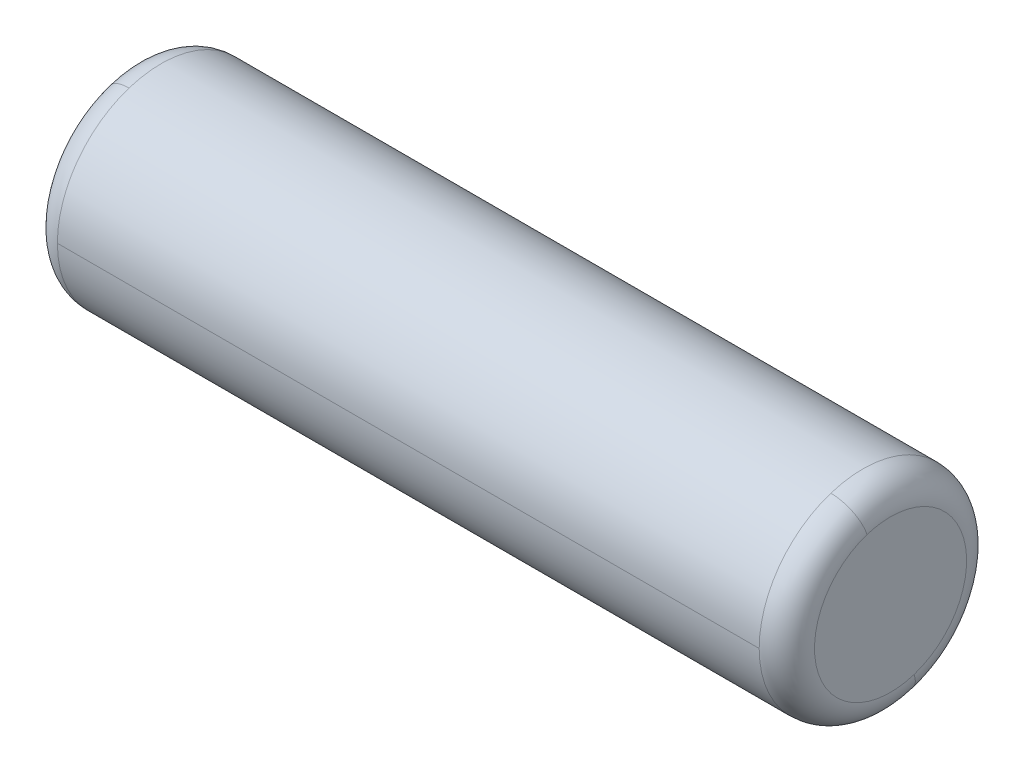
ISO-10303-21;
HEADER;
FILE_DESCRIPTION(('STEP AP214'),'2;1');
FILE_NAME('part.step','',(''),(''),'','','');
FILE_SCHEMA(('AUTOMOTIVE_DESIGN { 1 0 10303 214 1 1 1 1 }'));
ENDSEC;
DATA;
#1=APPLICATION_CONTEXT('core data for automotive mechanical design processes');
#2=APPLICATION_PROTOCOL_DEFINITION('international standard','automotive_design',2000,#1);
#3=PRODUCT_CONTEXT('',#1,'mechanical');
#4=PRODUCT('Part','Part','',(#3));
#5=PRODUCT_RELATED_PRODUCT_CATEGORY('part','',(#4));
#6=PRODUCT_DEFINITION_FORMATION('','',#4);
#7=PRODUCT_DEFINITION_CONTEXT('part definition',#1,'design');
#8=PRODUCT_DEFINITION('design','',#6,#7);
#9=PRODUCT_DEFINITION_SHAPE('','',#8);
#10=(LENGTH_UNIT() NAMED_UNIT(*) SI_UNIT(.MILLI.,.METRE.));
#11=(NAMED_UNIT(*) PLANE_ANGLE_UNIT() SI_UNIT($,.RADIAN.));
#12=(NAMED_UNIT(*) SI_UNIT($,.STERADIAN.) SOLID_ANGLE_UNIT());
#13=UNCERTAINTY_MEASURE_WITH_UNIT(LENGTH_MEASURE(1.E-05),#10,'distance_accuracy_value','');
#14=(GEOMETRIC_REPRESENTATION_CONTEXT(3) GLOBAL_UNCERTAINTY_ASSIGNED_CONTEXT((#13)) GLOBAL_UNIT_ASSIGNED_CONTEXT((#10,
#11,#12)) REPRESENTATION_CONTEXT('',''));
#15=CARTESIAN_POINT('',(0.,0.,0.));
#16=DIRECTION('',(0.,0.,1.));
#17=DIRECTION('',(1.,0.,0.));
#18=AXIS2_PLACEMENT_3D('',#15,#16,#17);
#19=CARTESIAN_POINT('',(2.35,8.,0.));
#20=DIRECTION('',(1.,0.,0.));
#21=DIRECTION('',(0.,0.,-1.));
#22=AXIS2_PLACEMENT_3D('',#19,#20,#21);
#23=PLANE('',#22);
#24=CARTESIAN_POINT('',(2.35,8.69744144528296,0.226612462541579));
#25=CARTESIAN_POINT('',(2.35,8.69373374586507,0.238024411682907));
#26=CARTESIAN_POINT('',(2.35,8.6897454884511,0.249345179232635));
#27=CARTESIAN_POINT('',(2.35,8.68121851156343,0.271777475978529));
#28=CARTESIAN_POINT('',(2.35,8.67667979208974,0.282889005174697));
#29=CARTESIAN_POINT('',(2.35,8.6670625450151,0.304875950043115));
#30=CARTESIAN_POINT('',(2.35,8.66198401741415,0.315751365715366));
#31=CARTESIAN_POINT('',(2.35,8.65129946379298,0.337239912249846));
#32=CARTESIAN_POINT('',(2.35,8.64569343777276,0.347853043112075));
#33=CARTESIAN_POINT('',(2.35,8.6339673726004,0.368791444416637));
#34=CARTESIAN_POINT('',(2.35,8.62784733344826,0.37911671485897));
#35=CARTESIAN_POINT('',(2.35,8.61510799111368,0.399454522892141));
#36=CARTESIAN_POINT('',(2.35,8.60848868793123,0.409467060482979));
#37=CARTESIAN_POINT('',(2.35,8.5947667625726,0.429155281184004));
#38=CARTESIAN_POINT('',(2.35,8.58766414039641,0.438830964294191));
#39=CARTESIAN_POINT('',(2.35,8.57299268827631,0.457822166612945));
#40=CARTESIAN_POINT('',(2.35,8.5654238583324,0.467137685821512));
#41=CARTESIAN_POINT('',(2.35,8.54983822454741,0.485386118395884));
#42=CARTESIAN_POINT('',(2.35,8.54182142070634,0.49431903176169));
#43=CARTESIAN_POINT('',(2.35,8.52535915233747,0.511780732490374));
#44=CARTESIAN_POINT('',(2.35,8.51691368780968,0.520309519853254));
#45=CARTESIAN_POINT('',(2.35,8.4996144439237,0.536942421977464));
#46=CARTESIAN_POINT('',(2.35,8.49076066456552,0.545046536738796));
#47=CARTESIAN_POINT('',(2.35,8.47266612055073,0.560810570138373));
#48=CARTESIAN_POINT('',(2.35,8.46342535589413,0.568470488776618));
#49=CARTESIAN_POINT('',(2.35,8.44457910309343,0.583327676514891));
#50=CARTESIAN_POINT('',(2.35,8.43497361494933,0.590524945614918));
#51=CARTESIAN_POINT('',(2.35,8.41542105563604,0.60443949542514));
#52=CARTESIAN_POINT('',(2.35,8.40547398446686,0.611156776135335));
#53=CARTESIAN_POINT('',(2.35,8.3852622224691,0.624095166648283));
#54=CARTESIAN_POINT('',(2.35,8.37499753164051,0.630316276451037));
#55=CARTESIAN_POINT('',(2.35,8.35417525886322,0.642247337950685));
#56=CARTESIAN_POINT('',(2.35,8.34361767691453,0.64795728964758));
#57=CARTESIAN_POINT('',(2.35,8.32223505603667,0.658852279161742));
#58=CARTESIAN_POINT('',(2.35,8.3114100171075,0.664037316979008));
#59=CARTESIAN_POINT('',(2.35,8.28951856073565,0.673869987523654));
#60=CARTESIAN_POINT('',(2.35,8.27845214329297,0.678517620251034));
#61=CARTESIAN_POINT('',(2.35,8.256104589863,0.687264284061582));
#62=CARTESIAN_POINT('',(2.35,8.24482345387572,0.69136331514475));
#63=CARTESIAN_POINT('',(2.35,8.22207364060126,0.699002900741963));
#64=CARTESIAN_POINT('',(2.35,8.21060496331408,0.702543455256008));
#65=CARTESIAN_POINT('',(2.35,8.18750769648795,0.709057558209035));
#66=CARTESIAN_POINT('',(2.35,8.175879106949,0.712031106648016));
#67=CARTESIAN_POINT('',(2.35,8.15249002991007,0.717404033912273));
#68=CARTESIAN_POINT('',(2.35,8.14072954241009,0.719803412737549));
#69=CARTESIAN_POINT('',(2.35,8.11710500149358,0.724022220460645));
#70=CARTESIAN_POINT('',(2.35,8.10524094807706,0.725841649358465));
#71=CARTESIAN_POINT('',(2.35,8.08143785687131,0.728896174063071));
#72=CARTESIAN_POINT('',(2.35,8.06949881908209,0.730131269869857));
#73=CARTESIAN_POINT('',(2.35,8.04557452131872,0.732014152938414));
#74=CARTESIAN_POINT('',(2.35,8.03358926134458,0.732661940200186));
#75=CARTESIAN_POINT('',(2.35,8.00960139275243,0.733368645602461));
#76=CARTESIAN_POINT('',(2.35,7.99759878413442,0.733427563742966));
#77=CARTESIAN_POINT('',(2.35,7.97360513359,0.732956388963745));
#78=CARTESIAN_POINT('',(2.35,7.9616140916636,0.732426296044021));
#79=CARTESIAN_POINT('',(2.35,7.93767246197268,0.730778376184618));
#80=CARTESIAN_POINT('',(2.35,7.92572187420817,0.72966054924494));
#81=CARTESIAN_POINT('',(2.35,7.90188994285371,0.726839854288637));
#82=CARTESIAN_POINT('',(2.35,7.89000859926377,0.725136986272012));
#83=CARTESIAN_POINT('',(2.35,7.86634377945583,0.721150311520021));
#84=CARTESIAN_POINT('',(2.35,7.85456030323785,0.718866504784656));
#85=CARTESIAN_POINT('',(2.35,7.83111960560015,0.713723454485647));
#86=CARTESIAN_POINT('',(2.35,7.81946238418044,0.710864210922004));
#87=CARTESIAN_POINT('',(2.35,7.79630227940675,0.704577175134626));
#88=CARTESIAN_POINT('',(2.35,7.78479939605277,0.70114938291089));
#89=CARTESIAN_POINT('',(2.35,7.76197567886407,0.693733507655033));
#90=CARTESIAN_POINT('',(2.35,7.75065484502936,0.689745424622912));
#91=CARTESIAN_POINT('',(2.35,7.72822249975948,0.681218575391621));
#92=CARTESIAN_POINT('',(2.35,7.71711098832432,0.676679809192452));
#93=CARTESIAN_POINT('',(2.35,7.69512405645787,0.66706252791239));
#94=CARTESIAN_POINT('',(2.35,7.68424863602657,0.661984012831497));
#95=CARTESIAN_POINT('',(2.35,7.66276008600822,0.651299468375642));
#96=CARTESIAN_POINT('',(2.35,7.65214695642118,0.64569343900068));
#97=CARTESIAN_POINT('',(2.35,7.63120855605011,0.63396737137248));
#98=CARTESIAN_POINT('',(2.35,7.6208832852661,0.627847333119244));
#99=CARTESIAN_POINT('',(2.35,7.60054547698279,0.615107991442699));
#100=CARTESIAN_POINT('',(2.35,7.59053293948351,0.608488688019392));
#101=CARTESIAN_POINT('',(2.35,7.57084471884951,0.594766762484436));
#102=CARTESIAN_POINT('',(2.35,7.56116903571479,0.587664140372787));
#103=CARTESIAN_POINT('',(2.35,7.54217783337808,0.572992688299932));
#104=CARTESIAN_POINT('',(2.35,7.53286231417608,0.565423858338725));
#105=CARTESIAN_POINT('',(2.35,7.51461388160652,0.549838224541081));
#106=CARTESIAN_POINT('',(2.35,7.50568096823896,0.541821420704644));
#107=CARTESIAN_POINT('',(2.35,7.48821926750898,0.52535915233917));
#108=CARTESIAN_POINT('',(2.35,7.47969048014657,0.516913687810134));
#109=CARTESIAN_POINT('',(2.35,7.46305757802271,0.499614443923248));
#110=CARTESIAN_POINT('',(2.35,7.45495346326125,0.490760664565397));
#111=CARTESIAN_POINT('',(2.35,7.43918942986158,0.472666120550857));
#112=CARTESIAN_POINT('',(2.35,7.43152951122337,0.463425355894166));
#113=CARTESIAN_POINT('',(2.35,7.41667232348512,0.444579103093397));
#114=CARTESIAN_POINT('',(2.35,7.40947505438509,0.434973614949318));
#115=CARTESIAN_POINT('',(2.35,7.39556050457486,0.415421055636054));
#116=CARTESIAN_POINT('',(2.35,7.38884322386466,0.405473984466868));
#117=CARTESIAN_POINT('',(2.35,7.37590483335172,0.385262222469097));
#118=CARTESIAN_POINT('',(2.35,7.36968372354896,0.374997531640512));
#119=CARTESIAN_POINT('',(2.35,7.35775266204932,0.354175258863227));
#120=CARTESIAN_POINT('',(2.35,7.35204271035242,0.343617676914528));
#121=CARTESIAN_POINT('',(2.35,7.34114772083826,0.322235056036667));
#122=CARTESIAN_POINT('',(2.35,7.33596268302099,0.311410017107504));
#123=CARTESIAN_POINT('',(2.35,7.32613001247635,0.289518560735656));
#124=CARTESIAN_POINT('',(2.35,7.32148237974896,0.27845214329297));
#125=CARTESIAN_POINT('',(2.35,7.31273571593842,0.256104589863003));
#126=CARTESIAN_POINT('',(2.35,7.30863668485526,0.244823453875721));
#127=CARTESIAN_POINT('',(2.35,7.30099709925803,0.222073640601254));
#128=CARTESIAN_POINT('',(2.35,7.29745654474396,0.210604963314069));
#129=CARTESIAN_POINT('',(2.35,7.290942441791,0.187507696487958));
#130=CARTESIAN_POINT('',(2.35,7.28796889335211,0.175879106949032));
#131=CARTESIAN_POINT('',(2.35,7.2825959660876,0.152490029910033));
#132=CARTESIAN_POINT('',(2.35,7.28019658726198,0.140729542409959));
#133=CARTESIAN_POINT('',(2.35,7.27597777953982,0.117105001493709));
#134=CARTESIAN_POINT('',(2.35,7.27415835064329,0.105240948077533));
#135=CARTESIAN_POINT('',(2.35,7.27110382593518,0.0814378568708378));
#136=CARTESIAN_POINT('',(2.35,7.26986873012361,0.0694988190803187));
#137=CARTESIAN_POINT('',(2.35,7.26798584706812,0.0455745213205006));
#138=CARTESIAN_POINT('',(2.35,7.2673380598242,0.0335892613512017));
#139=CARTESIAN_POINT('',(2.35,7.26663135437315,0.00960139274580662));
#140=CARTESIAN_POINT('',(2.35,7.26657243616601,-0.00240121589028959));
#141=CARTESIAN_POINT('',(2.35,7.26704361112728,-0.026394866385287));
#142=CARTESIAN_POINT('',(2.35,7.26757370429567,-0.0383859082441882));
#143=CARTESIAN_POINT('',(2.35,7.26922162347569,-0.0623275381195325));
#144=CARTESIAN_POINT('',(2.35,7.27033944948731,-0.0742781261359757));
#145=CARTESIAN_POINT('',(2.35,7.27316014697912,-0.0981100568021429));
#146=CARTESIAN_POINT('',(2.35,7.27486301845932,-0.109991399451867));
#147=CARTESIAN_POINT('',(2.35,7.27884968374865,-0.13365622182853));
#148=CARTESIAN_POINT('',(2.35,7.28113347755778,-0.145439701555469));
#149=CARTESIAN_POINT('',(2.35,7.28627656317192,-0.168880389606531));
#150=CARTESIAN_POINT('',(2.35,7.28913585497692,-0.180537597930652));
#151=CARTESIAN_POINT('',(2.35,7.29542275896644,-0.203697738482153));
#152=CARTESIAN_POINT('',(2.35,7.29885037115096,-0.215200670709532));
#153=CARTESIAN_POINT('',(2.35,7.30255855471704,-0.226612462541576));
#154=B_SPLINE_CURVE_WITH_KNOTS('',3,(#24,#25,#26,#27,#28,#29,#30,#31,#32,#33,#34,#35,#36,#37,
#38,#39,#40,#41,#42,#43,#44,#45,#46,#47,#48,#49,#50,#51,#52,#53,#54,#55,#56,#57,#58,#59,#60,#61,
#62,#63,#64,#65,#66,#67,#68,#69,#70,#71,#72,#73,#74,#75,#76,#77,#78,#79,#80,#81,#82,#83,#84,#85,
#86,#87,#88,#89,#90,#91,#92,#93,#94,#95,#96,#97,#98,#99,#100,#101,#102,#103,#104,#105,#106,#107,
#108,#109,#110,#111,#112,#113,#114,#115,#116,#117,#118,#119,#120,#121,#122,#123,#124,#125,#126,
#127,#128,#129,#130,#131,#132,#133,#134,#135,#136,#137,#138,#139,#140,#141,#142,#143,#144,#145,
#146,#147,#148,#149,#150,#151,#152,#153),.UNSPECIFIED.,.F.,.F.,(4,2,2,2,2,2,2,2,2,2,2,2,2,2,2,2,
2,2,2,2,2,2,2,2,2,2,2,2,2,2,2,2,2,2,2,2,2,2,2,2,2,2,2,2,2,2,2,2,2,2,2,2,2,2,2,2,2,2,2,2,2,2,2,2,
4),(0.,0.0359938018335968,0.0719876036671936,0.107981405500791,0.143975207334387,
0.179969009167985,0.215962811001581,0.251956612835178,0.287950414668774,0.323944216502372,
0.359938018335968,0.395931820169565,0.431925622003162,0.467919423836759,0.503913225670357,
0.539907027503953,0.57590082933755,0.611894631171146,0.647888433004743,0.683882234838341,
0.719876036671937,0.755869838505534,0.79186364033913,0.827857442172728,0.863851244006325,
0.899845045839922,0.935838847673518,0.971832649507114,1.00782645134071,1.04382025317431,
1.07981405500791,1.1158078568415,1.1518016586751,1.1877954605087,1.22378926234229,
1.25978306417589,1.29577686600949,1.33177066784308,1.36776446967668,1.40375827151028,
1.43975207334387,1.47574587517747,1.51173967701107,1.54773347884467,1.58372728067826,
1.61972108251186,1.65571488434545,1.69170868617905,1.72770248801265,1.76369628984625,
1.79969009167984,1.83568389351344,1.87167769534704,1.90767149718063,1.94366529901423,
1.97965910084783,2.01565290268142,2.05164670451502,2.08764050634862,2.12363430818221,
2.15962811001581,2.19562191184941,2.231615713683,2.2676095155166,2.3036033173502),.UNSPECIFIED.);
#155=CARTESIAN_POINT('',(2.35,8.69744144528296,0.226612462541579));
#156=VERTEX_POINT('',#155);
#157=CARTESIAN_POINT('',(2.35,7.30255855471704,-0.226612462541579));
#158=VERTEX_POINT('',#157);
#159=EDGE_CURVE('E11',#156,#158,#154,.T.);
#160=ORIENTED_EDGE('',*,*,#159,.F.);
#161=CARTESIAN_POINT('',(2.35,7.30255855471704,-0.226612462541579));
#162=CARTESIAN_POINT('',(2.35,7.30626625413493,-0.238024411682907));
#163=CARTESIAN_POINT('',(2.35,7.3102545115489,-0.249345179232634));
#164=CARTESIAN_POINT('',(2.35,7.31878148843657,-0.271777475978529));
#165=CARTESIAN_POINT('',(2.35,7.32332020791026,-0.282889005174697));
#166=CARTESIAN_POINT('',(2.35,7.3329374549849,-0.304875950043115));
#167=CARTESIAN_POINT('',(2.35,7.33801598258585,-0.315751365715366));
#168=CARTESIAN_POINT('',(2.35,7.34870053620702,-0.337239912249845));
#169=CARTESIAN_POINT('',(2.35,7.35430656222724,-0.347853043112074));
#170=CARTESIAN_POINT('',(2.35,7.3660326273996,-0.368791444416637));
#171=CARTESIAN_POINT('',(2.35,7.37215266655174,-0.37911671485897));
#172=CARTESIAN_POINT('',(2.35,7.38489200888632,-0.399454522892141));
#173=CARTESIAN_POINT('',(2.35,7.39151131206877,-0.409467060482979));
#174=CARTESIAN_POINT('',(2.35,7.4052332374274,-0.429155281184004));
#175=CARTESIAN_POINT('',(2.35,7.41233585960359,-0.438830964294191));
#176=CARTESIAN_POINT('',(2.35,7.42700731172369,-0.457822166612945));
#177=CARTESIAN_POINT('',(2.35,7.43457614166761,-0.467137685821511));
#178=CARTESIAN_POINT('',(2.35,7.45016177545259,-0.485386118395884));
#179=CARTESIAN_POINT('',(2.35,7.45817857929366,-0.49431903176169));
#180=CARTESIAN_POINT('',(2.35,7.47464084766253,-0.511780732490374));
#181=CARTESIAN_POINT('',(2.35,7.48308631219032,-0.520309519853254));
#182=CARTESIAN_POINT('',(2.35,7.5003855560763,-0.536942421977464));
#183=CARTESIAN_POINT('',(2.35,7.50923933543448,-0.545046536738796));
#184=CARTESIAN_POINT('',(2.35,7.52733387944927,-0.560810570138372));
#185=CARTESIAN_POINT('',(2.35,7.53657464410587,-0.568470488776618));
#186=CARTESIAN_POINT('',(2.35,7.55542089690657,-0.583327676514891));
#187=CARTESIAN_POINT('',(2.35,7.56502638505067,-0.590524945614918));
#188=CARTESIAN_POINT('',(2.35,7.58457894436396,-0.60443949542514));
#189=CARTESIAN_POINT('',(2.35,7.59452601553313,-0.611156776135335));
#190=CARTESIAN_POINT('',(2.35,7.6147377775309,-0.624095166648283));
#191=CARTESIAN_POINT('',(2.35,7.62500246835949,-0.630316276451036));
#192=CARTESIAN_POINT('',(2.35,7.64582474113677,-0.642247337950685));
#193=CARTESIAN_POINT('',(2.35,7.65638232308547,-0.64795728964758));
#194=CARTESIAN_POINT('',(2.35,7.67776494396333,-0.658852279161742));
#195=CARTESIAN_POINT('',(2.35,7.6885899828925,-0.664037316979008));
#196=CARTESIAN_POINT('',(2.35,7.71048143926435,-0.673869987523654));
#197=CARTESIAN_POINT('',(2.35,7.72154785670703,-0.678517620251034));
#198=CARTESIAN_POINT('',(2.35,7.743895410137,-0.687264284061582));
#199=CARTESIAN_POINT('',(2.35,7.75517654612428,-0.69136331514475));
#200=CARTESIAN_POINT('',(2.35,7.77792635939874,-0.699002900741963));
#201=CARTESIAN_POINT('',(2.35,7.78939503668592,-0.702543455256008));
#202=CARTESIAN_POINT('',(2.35,7.81249230351205,-0.709057558209034));
#203=CARTESIAN_POINT('',(2.35,7.824120893051,-0.712031106648016));
#204=CARTESIAN_POINT('',(2.35,7.84750997008993,-0.717404033912273));
#205=CARTESIAN_POINT('',(2.35,7.85927045758991,-0.719803412737549));
#206=CARTESIAN_POINT('',(2.35,7.88289499850642,-0.724022220460645));
#207=CARTESIAN_POINT('',(2.35,7.89475905192294,-0.725841649358465));
#208=CARTESIAN_POINT('',(2.35,7.91856214312869,-0.728896174063071));
#209=CARTESIAN_POINT('',(2.35,7.93050118091791,-0.730131269869856));
#210=CARTESIAN_POINT('',(2.35,7.95442547868127,-0.732014152938414));
#211=CARTESIAN_POINT('',(2.35,7.96641073865542,-0.732661940200185));
#212=CARTESIAN_POINT('',(2.35,7.99039860724757,-0.733368645602461));
#213=CARTESIAN_POINT('',(2.35,8.00240121586558,-0.733427563742965));
#214=CARTESIAN_POINT('',(2.35,8.02639486641,-0.732956388963745));
#215=CARTESIAN_POINT('',(2.35,8.0383859083364,-0.732426296044021));
#216=CARTESIAN_POINT('',(2.35,8.06232753802732,-0.730778376184618));
#217=CARTESIAN_POINT('',(2.35,8.07427812579183,-0.72966054924494));
#218=CARTESIAN_POINT('',(2.35,8.09811005714629,-0.726839854288637));
#219=CARTESIAN_POINT('',(2.35,8.10999140073623,-0.725136986272012));
#220=CARTESIAN_POINT('',(2.35,8.13365622054417,-0.721150311520021));
#221=CARTESIAN_POINT('',(2.35,8.14543969676215,-0.718866504784656));
#222=CARTESIAN_POINT('',(2.35,8.16888039439985,-0.713723454485647));
#223=CARTESIAN_POINT('',(2.35,8.18053761581956,-0.710864210922004));
#224=CARTESIAN_POINT('',(2.35,8.20369772059325,-0.704577175134626));
#225=CARTESIAN_POINT('',(2.35,8.21520060394723,-0.701149382910891));
#226=CARTESIAN_POINT('',(2.35,8.23802432113592,-0.693733507655033));
#227=CARTESIAN_POINT('',(2.35,8.24934515497064,-0.689745424622912));
#228=CARTESIAN_POINT('',(2.35,8.27177750024052,-0.681218575391621));
#229=CARTESIAN_POINT('',(2.35,8.28288901167568,-0.676679809192452));
#230=CARTESIAN_POINT('',(2.35,8.30487594354213,-0.66706252791239));
#231=CARTESIAN_POINT('',(2.35,8.31575136397343,-0.661984012831497));
#232=CARTESIAN_POINT('',(2.35,8.33723991399178,-0.651299468375642));
#233=CARTESIAN_POINT('',(2.35,8.34785304357882,-0.64569343900068));
#234=CARTESIAN_POINT('',(2.35,8.36879144394989,-0.63396737137248));
#235=CARTESIAN_POINT('',(2.35,8.3791167147339,-0.627847333119244));
#236=CARTESIAN_POINT('',(2.35,8.39945452301721,-0.615107991442699));
#237=CARTESIAN_POINT('',(2.35,8.40946706051649,-0.608488688019392));
#238=CARTESIAN_POINT('',(2.35,8.42915528115049,-0.594766762484436));
#239=CARTESIAN_POINT('',(2.35,8.43883096428521,-0.587664140372787));
#240=CARTESIAN_POINT('',(2.35,8.45782216662192,-0.572992688299932));
#241=CARTESIAN_POINT('',(2.35,8.46713768582392,-0.565423858338725));
#242=CARTESIAN_POINT('',(2.35,8.48538611839348,-0.549838224541081));
#243=CARTESIAN_POINT('',(2.35,8.49431903176104,-0.541821420704644));
#244=CARTESIAN_POINT('',(2.35,8.51178073249102,-0.525359152339171));
#245=CARTESIAN_POINT('',(2.35,8.52030951985342,-0.516913687810134));
#246=CARTESIAN_POINT('',(2.35,8.53694242197729,-0.499614443923248));
#247=CARTESIAN_POINT('',(2.35,8.54504653673875,-0.490760664565398));
#248=CARTESIAN_POINT('',(2.35,8.56081057013842,-0.472666120550858));
#249=CARTESIAN_POINT('',(2.35,8.56847048877663,-0.463425355894167));
#250=CARTESIAN_POINT('',(2.35,8.58332767651488,-0.444579103093397));
#251=CARTESIAN_POINT('',(2.35,8.59052494561491,-0.434973614949319));
#252=CARTESIAN_POINT('',(2.35,8.60443949542514,-0.415421055636055));
#253=CARTESIAN_POINT('',(2.35,8.61115677613533,-0.405473984466869));
#254=CARTESIAN_POINT('',(2.35,8.62409516664828,-0.385262222469098));
#255=CARTESIAN_POINT('',(2.35,8.63031627645104,-0.374997531640513));
#256=CARTESIAN_POINT('',(2.35,8.64224733795068,-0.354175258863228));
#257=CARTESIAN_POINT('',(2.35,8.64795728964758,-0.343617676914529));
#258=CARTESIAN_POINT('',(2.35,8.65885227916174,-0.322235056036667));
#259=CARTESIAN_POINT('',(2.35,8.66403731697901,-0.311410017107504));
#260=CARTESIAN_POINT('',(2.35,8.67386998752365,-0.289518560735657));
#261=CARTESIAN_POINT('',(2.35,8.67851762025103,-0.278452143292971));
#262=CARTESIAN_POINT('',(2.35,8.68726428406158,-0.256104589863004));
#263=CARTESIAN_POINT('',(2.35,8.69136331514474,-0.244823453875722));
#264=CARTESIAN_POINT('',(2.35,8.69900290074197,-0.222073640601255));
#265=CARTESIAN_POINT('',(2.35,8.70254345525604,-0.21060496331407));
#266=CARTESIAN_POINT('',(2.35,8.709057558209,-0.187507696487959));
#267=CARTESIAN_POINT('',(2.35,8.71203110664789,-0.175879106949033));
#268=CARTESIAN_POINT('',(2.35,8.7174040339124,-0.152490029910034));
#269=CARTESIAN_POINT('',(2.35,8.71980341273802,-0.14072954240996));
#270=CARTESIAN_POINT('',(2.35,8.72402222046017,-0.117105001493711));
#271=CARTESIAN_POINT('',(2.35,8.72584164935671,-0.105240948077534));
#272=CARTESIAN_POINT('',(2.35,8.72889617406482,-0.0814378568708387));
#273=CARTESIAN_POINT('',(2.35,8.73013126987639,-0.0694988190803198));
#274=CARTESIAN_POINT('',(2.35,8.73201415293188,-0.045574521320502));
#275=CARTESIAN_POINT('',(2.35,8.7326619401758,-0.0335892613512031));
#276=CARTESIAN_POINT('',(2.35,8.73336864562685,-0.00960139274580803));
#277=CARTESIAN_POINT('',(2.35,8.73342756383399,0.00240121589028817));
#278=CARTESIAN_POINT('',(2.35,8.73295638887272,0.0263948663852856));
#279=CARTESIAN_POINT('',(2.35,8.73242629570433,0.0383859082441868));
#280=CARTESIAN_POINT('',(2.35,8.73077837652431,0.0623275381195311));
#281=CARTESIAN_POINT('',(2.35,8.72966055051269,0.0742781261359743));
#282=CARTESIAN_POINT('',(2.35,8.72683985302088,0.0981100568021416));
#283=CARTESIAN_POINT('',(2.35,8.72513698154068,0.109991399451866));
#284=CARTESIAN_POINT('',(2.35,8.72115031625135,0.133656221828529));
#285=CARTESIAN_POINT('',(2.35,8.71886652244222,0.145439701555469));
#286=CARTESIAN_POINT('',(2.35,8.71372343682808,0.16888038960653));
#287=CARTESIAN_POINT('',(2.35,8.71086414502308,0.180537597930652));
#288=CARTESIAN_POINT('',(2.35,8.70457724103356,0.203697738482152));
#289=CARTESIAN_POINT('',(2.35,8.70114962884904,0.215200670709531));
#290=CARTESIAN_POINT('',(2.35,8.69744144528296,0.226612462541575));
#291=B_SPLINE_CURVE_WITH_KNOTS('',3,(#161,#162,#163,#164,#165,#166,#167,#168,#169,#170,#171,
#172,#173,#174,#175,#176,#177,#178,#179,#180,#181,#182,#183,#184,#185,#186,#187,#188,#189,#190,
#191,#192,#193,#194,#195,#196,#197,#198,#199,#200,#201,#202,#203,#204,#205,#206,#207,#208,#209,
#210,#211,#212,#213,#214,#215,#216,#217,#218,#219,#220,#221,#222,#223,#224,#225,#226,#227,#228,
#229,#230,#231,#232,#233,#234,#235,#236,#237,#238,#239,#240,#241,#242,#243,#244,#245,#246,#247,
#248,#249,#250,#251,#252,#253,#254,#255,#256,#257,#258,#259,#260,#261,#262,#263,#264,#265,#266,
#267,#268,#269,#270,#271,#272,#273,#274,#275,#276,#277,#278,#279,#280,#281,#282,#283,#284,#285,
#286,#287,#288,#289,#290),.UNSPECIFIED.,.F.,.F.,(4,2,2,2,2,2,2,2,2,2,2,2,2,2,2,2,2,2,2,2,2,2,2,
2,2,2,2,2,2,2,2,2,2,2,2,2,2,2,2,2,2,2,2,2,2,2,2,2,2,2,2,2,2,2,2,2,2,2,2,2,2,2,2,2,4),(0.,
0.0359938018335969,0.0719876036671935,0.10798140550079,0.143975207334387,0.179969009167984,
0.215962811001581,0.251956612835178,0.287950414668775,0.323944216502372,0.359938018335968,
0.395931820169565,0.431925622003162,0.467919423836759,0.503913225670355,0.539907027503952,
0.57590082933755,0.611894631171147,0.647888433004743,0.68388223483834,0.719876036671937,
0.755869838505533,0.79186364033913,0.827857442172728,0.863851244006323,0.89984504583992,
0.935838847673518,0.971832649507114,1.00782645134071,1.04382025317431,1.0798140550079,
1.1158078568415,1.1518016586751,1.18779546050869,1.22378926234229,1.25978306417589,
1.29577686600949,1.33177066784308,1.36776446967668,1.40375827151028,1.43975207334387,
1.47574587517747,1.51173967701107,1.54773347884466,1.58372728067826,1.61972108251186,
1.65571488434545,1.69170868617905,1.72770248801265,1.76369628984624,1.79969009167984,
1.83568389351344,1.87167769534703,1.90767149718063,1.94366529901423,1.97965910084782,
2.01565290268142,2.05164670451502,2.08764050634861,2.12363430818221,2.15962811001581,
2.19562191184941,2.231615713683,2.2676095155166,2.3036033173502),.UNSPECIFIED.);
#292=EDGE_CURVE('E25',#158,#156,#291,.T.);
#293=ORIENTED_EDGE('',*,*,#292,.F.);
#294=EDGE_LOOP('',(#160,#293));
#295=FACE_BOUND('',#294,.T.);
#296=ADVANCED_FACE('F16',(#295),#23,.F.);
#297=CARTESIAN_POINT('',(2.61666666666683,8.,0.));
#298=DIRECTION('',(1.,0.,0.));
#299=DIRECTION('',(0.,-0.309016994374947,0.951056516295154));
#300=AXIS2_PLACEMENT_3D('',#297,#298,#299);
#301=TOROIDAL_SURFACE('',#300,0.733333333333175,0.266666666666826);
#302=CARTESIAN_POINT('',(2.61666666666683,7.30255855471704,-0.226612462541579));
#303=DIRECTION('',(0.,0.309016994374947,-0.951056516295154));
#304=DIRECTION('',(-4.72955008490034E-13,-0.951056516295154,-0.309016994374947));
#305=AXIS2_PLACEMENT_3D('',#302,#303,#304);
#306=CIRCLE('',#305,0.266666666666826);
#307=CARTESIAN_POINT('',(2.6166666666667,7.04894348370485,-0.309016994374947));
#308=VERTEX_POINT('',#307);
#309=EDGE_CURVE('E138',#308,#158,#306,.T.);
#310=ORIENTED_EDGE('',*,*,#309,.T.);
#311=ORIENTED_EDGE('',*,*,#292,.T.);
#312=CARTESIAN_POINT('',(2.61666666666683,8.69744144528296,0.226612462541579));
#313=DIRECTION('',(0.,-0.309016994374948,0.951056516295153));
#314=DIRECTION('',(-4.71289673953099E-13,0.951056516295153,0.309016994374948));
#315=AXIS2_PLACEMENT_3D('',#312,#313,#314);
#316=CIRCLE('',#315,0.266666666666825);
#317=CARTESIAN_POINT('',(2.6166666666667,8.95105651629515,0.309016994374948));
#318=VERTEX_POINT('',#317);
#319=EDGE_CURVE('E134',#318,#156,#316,.T.);
#320=ORIENTED_EDGE('',*,*,#319,.F.);
#321=CARTESIAN_POINT('',(2.6166666666667,8.,0.));
#322=DIRECTION('',(1.,0.,0.));
#323=DIRECTION('',(0.,0.,-1.));
#324=AXIS2_PLACEMENT_3D('',#321,#322,#323);
#325=CIRCLE('',#324,1.);
#326=CARTESIAN_POINT('',(2.6166666666667,8.,-1.));
#327=VERTEX_POINT('',#326);
#328=EDGE_CURVE('E129',#327,#318,#325,.T.);
#329=ORIENTED_EDGE('',*,*,#328,.F.);
#330=CARTESIAN_POINT('',(2.6166666666667,8.,0.));
#331=DIRECTION('',(1.,0.,0.));
#332=DIRECTION('',(0.,0.,-1.));
#333=AXIS2_PLACEMENT_3D('',#330,#331,#332);
#334=CIRCLE('',#333,1.);
#335=EDGE_CURVE('E124',#308,#327,#334,.T.);
#336=ORIENTED_EDGE('',*,*,#335,.F.);
#337=EDGE_LOOP('',(#310,#311,#320,#329,#336));
#338=FACE_BOUND('',#337,.T.);
#339=ADVANCED_FACE('F145',(#338),#301,.T.);
#340=CARTESIAN_POINT('',(9.65,8.,0.));
#341=DIRECTION('',(1.,0.,0.));
#342=DIRECTION('',(0.,1.,0.));
#343=AXIS2_PLACEMENT_3D('',#340,#341,#342);
#344=CYLINDRICAL_SURFACE('',#343,1.);
#345=DIRECTION('',(1.,0.,0.));
#346=VECTOR('',#345,1.);
#347=CARTESIAN_POINT('',(2.6166666666667,8.,1.));
#348=LINE('',#347,#346);
#349=CARTESIAN_POINT('',(2.6166666666667,8.,1.));
#350=VERTEX_POINT('',#349);
#351=CARTESIAN_POINT('',(9.3833333333333,8.,1.));
#352=VERTEX_POINT('',#351);
#353=EDGE_CURVE('E91',#350,#352,#348,.T.);
#354=ORIENTED_EDGE('',*,*,#353,.F.);
#355=CARTESIAN_POINT('',(2.6166666666667,8.,0.));
#356=DIRECTION('',(1.,0.,0.));
#357=DIRECTION('',(0.,0.,-1.));
#358=AXIS2_PLACEMENT_3D('',#355,#356,#357);
#359=CIRCLE('',#358,1.);
#360=EDGE_CURVE('E116',#350,#308,#359,.T.);
#361=ORIENTED_EDGE('',*,*,#360,.T.);
#362=ORIENTED_EDGE('',*,*,#335,.T.);
#363=DIRECTION('',(1.,0.,0.));
#364=VECTOR('',#363,1.);
#365=CARTESIAN_POINT('',(2.6166666666667,8.,-1.));
#366=LINE('',#365,#364);
#367=CARTESIAN_POINT('',(9.3833333333333,8.,-1.));
#368=VERTEX_POINT('',#367);
#369=EDGE_CURVE('E112',#327,#368,#366,.T.);
#370=ORIENTED_EDGE('',*,*,#369,.T.);
#371=CARTESIAN_POINT('',(9.3833333333333,8.,0.));
#372=DIRECTION('',(1.,0.,0.));
#373=DIRECTION('',(0.,0.,-1.));
#374=AXIS2_PLACEMENT_3D('',#371,#372,#373);
#375=CIRCLE('',#374,1.);
#376=CARTESIAN_POINT('',(9.3833333333333,7.04894348370485,-0.309016994374948));
#377=VERTEX_POINT('',#376);
#378=EDGE_CURVE('E83',#377,#368,#375,.T.);
#379=ORIENTED_EDGE('',*,*,#378,.F.);
#380=CARTESIAN_POINT('',(9.3833333333333,8.,0.));
#381=DIRECTION('',(1.,0.,0.));
#382=DIRECTION('',(0.,0.,-1.));
#383=AXIS2_PLACEMENT_3D('',#380,#381,#382);
#384=CIRCLE('',#383,1.);
#385=EDGE_CURVE('E105',#352,#377,#384,.T.);
#386=ORIENTED_EDGE('',*,*,#385,.F.);
#387=EDGE_LOOP('',(#354,#361,#362,#370,#379,#386));
#388=FACE_BOUND('',#387,.T.);
#389=ADVANCED_FACE('F154',(#388),#344,.T.);
#390=CARTESIAN_POINT('',(9.38333333333317,8.,0.));
#391=DIRECTION('',(1.,0.,0.));
#392=DIRECTION('',(0.,0.309016994374947,-0.951056516295154));
#393=AXIS2_PLACEMENT_3D('',#390,#391,#392);
#394=TOROIDAL_SURFACE('',#393,0.733333333333173,0.266666666666828);
#395=CARTESIAN_POINT('',(9.38333333333317,7.30255855471704,-0.226612462541578));
#396=DIRECTION('',(0.,0.309016994374947,-0.951056516295154));
#397=DIRECTION('',(1.,0.,0.));
#398=AXIS2_PLACEMENT_3D('',#395,#396,#397);
#399=CIRCLE('',#398,0.266666666666827);
#400=CARTESIAN_POINT('',(9.65,7.30255855471704,-0.226612462541579));
#401=VERTEX_POINT('',#400);
#402=EDGE_CURVE('E101',#401,#377,#399,.T.);
#403=ORIENTED_EDGE('',*,*,#402,.F.);
#404=CARTESIAN_POINT('',(9.65,8.,0.));
#405=DIRECTION('',(1.,0.,0.));
#406=DIRECTION('',(0.,0.,-1.));
#407=AXIS2_PLACEMENT_3D('',#404,#405,#406);
#408=CIRCLE('',#407,0.733333333333301);
#409=CARTESIAN_POINT('',(9.65,8.69744144528296,0.226612462541579));
#410=VERTEX_POINT('',#409);
#411=EDGE_CURVE('E73',#410,#401,#408,.T.);
#412=ORIENTED_EDGE('',*,*,#411,.F.);
#413=CARTESIAN_POINT('',(9.38333333333317,8.69744144528296,0.226612462541578));
#414=DIRECTION('',(0.,-0.309016994374947,0.951056516295154));
#415=DIRECTION('',(1.,0.,0.));
#416=AXIS2_PLACEMENT_3D('',#413,#414,#415);
#417=CIRCLE('',#416,0.266666666666827);
#418=CARTESIAN_POINT('',(9.3833333333333,8.95105651629515,0.309016994374948));
#419=VERTEX_POINT('',#418);
#420=EDGE_CURVE('E66',#410,#419,#417,.T.);
#421=ORIENTED_EDGE('',*,*,#420,.T.);
#422=CARTESIAN_POINT('',(9.3833333333333,8.,0.));
#423=DIRECTION('',(1.,0.,0.));
#424=DIRECTION('',(0.,0.,-1.));
#425=AXIS2_PLACEMENT_3D('',#422,#423,#424);
#426=CIRCLE('',#425,1.);
#427=EDGE_CURVE('E71',#419,#352,#426,.T.);
#428=ORIENTED_EDGE('',*,*,#427,.T.);
#429=ORIENTED_EDGE('',*,*,#385,.T.);
#430=EDGE_LOOP('',(#403,#412,#421,#428,#429));
#431=FACE_BOUND('',#430,.T.);
#432=ADVANCED_FACE('F68',(#431),#394,.T.);
#433=CARTESIAN_POINT('',(9.65,8.,0.));
#434=DIRECTION('',(1.,0.,0.));
#435=DIRECTION('',(0.,-1.,0.));
#436=AXIS2_PLACEMENT_3D('',#433,#434,#435);
#437=CYLINDRICAL_SURFACE('',#436,1.);
#438=ORIENTED_EDGE('',*,*,#353,.T.);
#439=ORIENTED_EDGE('',*,*,#427,.F.);
#440=CARTESIAN_POINT('',(9.3833333333333,8.,0.));
#441=DIRECTION('',(1.,0.,0.));
#442=DIRECTION('',(0.,0.,-1.));
#443=AXIS2_PLACEMENT_3D('',#440,#441,#442);
#444=CIRCLE('',#443,1.);
#445=EDGE_CURVE('E80',#368,#419,#444,.T.);
#446=ORIENTED_EDGE('',*,*,#445,.F.);
#447=ORIENTED_EDGE('',*,*,#369,.F.);
#448=ORIENTED_EDGE('',*,*,#328,.T.);
#449=CARTESIAN_POINT('',(2.6166666666667,8.,0.));
#450=DIRECTION('',(1.,0.,0.));
#451=DIRECTION('',(0.,0.,-1.));
#452=AXIS2_PLACEMENT_3D('',#449,#450,#451);
#453=CIRCLE('',#452,1.);
#454=EDGE_CURVE('E86',#318,#350,#453,.T.);
#455=ORIENTED_EDGE('',*,*,#454,.T.);
#456=EDGE_LOOP('',(#438,#439,#446,#447,#448,#455));
#457=FACE_BOUND('',#456,.T.);
#458=ADVANCED_FACE('F89',(#457),#437,.T.);
#459=CARTESIAN_POINT('',(2.61666666666683,8.,0.));
#460=DIRECTION('',(1.,0.,0.));
#461=DIRECTION('',(0.,0.309016994374947,-0.951056516295154));
#462=AXIS2_PLACEMENT_3D('',#459,#460,#461);
#463=TOROIDAL_SURFACE('',#462,0.733333333333175,0.266666666666826);
#464=ORIENTED_EDGE('',*,*,#309,.F.);
#465=ORIENTED_EDGE('',*,*,#360,.F.);
#466=ORIENTED_EDGE('',*,*,#454,.F.);
#467=ORIENTED_EDGE('',*,*,#319,.T.);
#468=ORIENTED_EDGE('',*,*,#159,.T.);
#469=EDGE_LOOP('',(#464,#465,#466,#467,#468));
#470=FACE_BOUND('',#469,.T.);
#471=ADVANCED_FACE('F163',(#470),#463,.T.);
#472=CARTESIAN_POINT('',(9.38333333333317,8.,0.));
#473=DIRECTION('',(1.,0.,0.));
#474=DIRECTION('',(0.,-0.309016994374947,0.951056516295154));
#475=AXIS2_PLACEMENT_3D('',#472,#473,#474);
#476=TOROIDAL_SURFACE('',#475,0.733333333333173,0.266666666666828);
#477=ORIENTED_EDGE('',*,*,#402,.T.);
#478=ORIENTED_EDGE('',*,*,#378,.T.);
#479=ORIENTED_EDGE('',*,*,#445,.T.);
#480=ORIENTED_EDGE('',*,*,#420,.F.);
#481=CARTESIAN_POINT('',(9.65,7.30255855471692,-0.226612462541618));
#482=CARTESIAN_POINT('',(9.65,7.37381768910431,-0.445622721072562));
#483=CARTESIAN_POINT('',(9.65,7.53069780879612,-0.637275857189457));
#484=CARTESIAN_POINT('',(9.65,7.76041545463908,-0.754024787079431));
#485=CARTESIAN_POINT('',(9.65,8.25450088851628,-0.783273194783016));
#486=CARTESIAN_POINT('',(9.65,8.63703261849484,-0.469194604486865));
#487=CARTESIAN_POINT('',(9.65,8.75425479867935,-0.239718091712948));
#488=CARTESIAN_POINT('',(9.65,8.76852259462449,0.00754437316359918));
#489=CARTESIAN_POINT('',(9.65,8.69744144528308,0.226612462541617));
#490=B_SPLINE_CURVE_WITH_KNOTS('',5,(#481,#482,#483,#484,#485,#486,#487,#488,#489),
.UNSPECIFIED.,.F.,.F.,(6,3,6),(0.,1.5707963267949,3.14159265358979),.UNSPECIFIED.);
#491=EDGE_CURVE('E184',#401,#410,#490,.T.);
#492=ORIENTED_EDGE('',*,*,#491,.F.);
#493=EDGE_LOOP('',(#477,#478,#479,#480,#492));
#494=FACE_BOUND('',#493,.T.);
#495=ADVANCED_FACE('F82',(#494),#476,.T.);
#496=CARTESIAN_POINT('',(9.65,8.7333333333333,0.));
#497=DIRECTION('',(-1.,0.,0.));
#498=DIRECTION('',(0.,0.,1.));
#499=AXIS2_PLACEMENT_3D('',#496,#497,#498);
#500=PLANE('',#499);
#501=ORIENTED_EDGE('',*,*,#491,.T.);
#502=ORIENTED_EDGE('',*,*,#411,.T.);
#503=EDGE_LOOP('',(#501,#502));
#504=FACE_BOUND('',#503,.T.);
#505=ADVANCED_FACE('F190',(#504),#500,.F.);
#506=CLOSED_SHELL('',(#296,#339,#389,#432,#458,#471,#495,#505));
#507=MANIFOLD_SOLID_BREP('B1',#506);
#508=ADVANCED_BREP_SHAPE_REPRESENTATION('',(#18,#507),#14);
#509=SHAPE_DEFINITION_REPRESENTATION(#9,#508);
ENDSEC;
END-ISO-10303-21;
